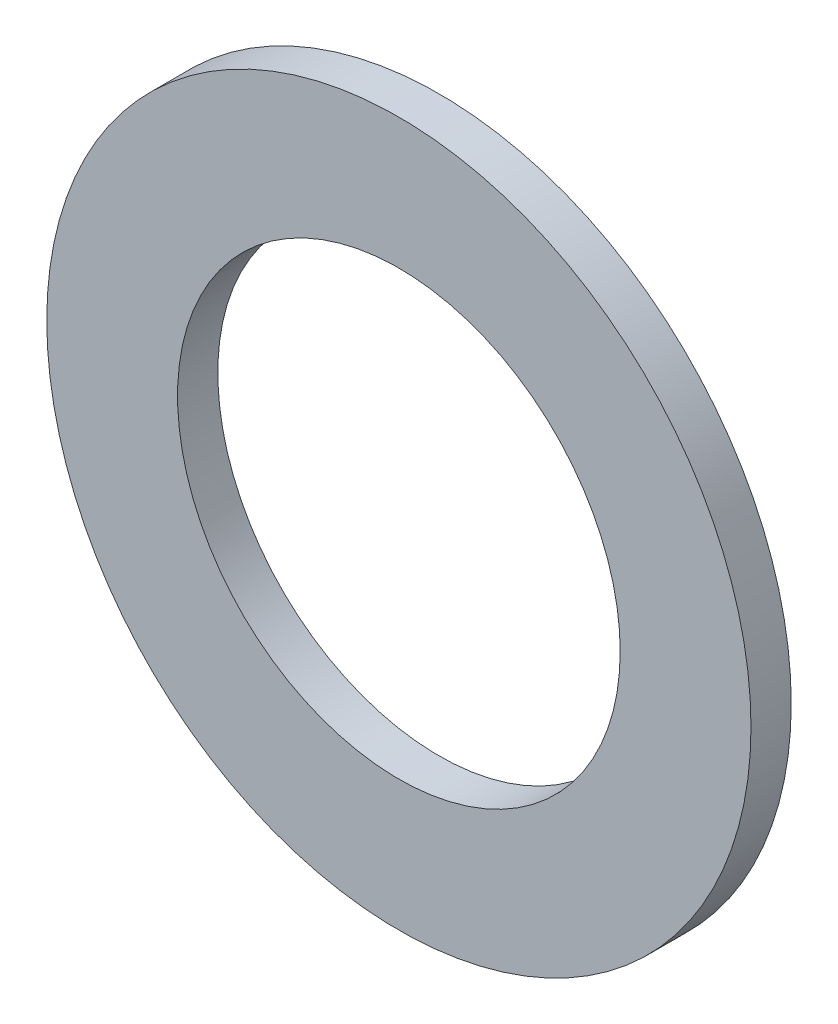
ISO-10303-21;
HEADER;
FILE_DESCRIPTION(('STEP AP214'),'2;1');
FILE_NAME('part.step','',(''),(''),'','','');
FILE_SCHEMA(('AUTOMOTIVE_DESIGN { 1 0 10303 214 1 1 1 1 }'));
ENDSEC;
DATA;
#1=APPLICATION_CONTEXT('core data for automotive mechanical design processes');
#2=APPLICATION_PROTOCOL_DEFINITION('international standard','automotive_design',2000,#1);
#3=PRODUCT_CONTEXT('',#1,'mechanical');
#4=PRODUCT('Part','Part','',(#3));
#5=PRODUCT_RELATED_PRODUCT_CATEGORY('part','',(#4));
#6=PRODUCT_DEFINITION_FORMATION('','',#4);
#7=PRODUCT_DEFINITION_CONTEXT('part definition',#1,'design');
#8=PRODUCT_DEFINITION('design','',#6,#7);
#9=PRODUCT_DEFINITION_SHAPE('','',#8);
#10=(LENGTH_UNIT() NAMED_UNIT(*) SI_UNIT(.MILLI.,.METRE.));
#11=(NAMED_UNIT(*) PLANE_ANGLE_UNIT() SI_UNIT($,.RADIAN.));
#12=(NAMED_UNIT(*) SI_UNIT($,.STERADIAN.) SOLID_ANGLE_UNIT());
#13=UNCERTAINTY_MEASURE_WITH_UNIT(LENGTH_MEASURE(1.E-05),#10,'distance_accuracy_value','');
#14=(GEOMETRIC_REPRESENTATION_CONTEXT(3) GLOBAL_UNCERTAINTY_ASSIGNED_CONTEXT((#13)) GLOBAL_UNIT_ASSIGNED_CONTEXT((#10,
#11,#12)) REPRESENTATION_CONTEXT('',''));
#15=CARTESIAN_POINT('',(0.,0.,0.));
#16=DIRECTION('',(0.,0.,1.));
#17=DIRECTION('',(1.,0.,0.));
#18=AXIS2_PLACEMENT_3D('',#15,#16,#17);
#19=CARTESIAN_POINT('',(-25.,0.,2.));
#20=DIRECTION('',(0.,0.,1.));
#21=DIRECTION('',(1.,0.,0.));
#22=AXIS2_PLACEMENT_3D('',#19,#20,#21);
#23=PLANE('',#22);
#24=CARTESIAN_POINT('',(-25.,0.,2.));
#25=DIRECTION('',(0.,0.,1.));
#26=DIRECTION('',(1.,0.,0.));
#27=AXIS2_PLACEMENT_3D('',#24,#25,#26);
#28=CIRCLE('',#27,17.5);
#29=CARTESIAN_POINT('',(-7.49999999999997,0.,2.00000000000002));
#30=VERTEX_POINT('',#29);
#31=EDGE_CURVE('E12',#30,#30,#28,.T.);
#32=ORIENTED_EDGE('',*,*,#31,.T.);
#33=EDGE_LOOP('',(#32));
#34=FACE_BOUND('',#33,.T.);
#35=CARTESIAN_POINT('',(-25.,0.,2.));
#36=DIRECTION('',(0.,0.,1.));
#37=DIRECTION('',(1.,0.,0.));
#38=AXIS2_PLACEMENT_3D('',#35,#36,#37);
#39=CIRCLE('',#38,11.);
#40=CARTESIAN_POINT('',(-14.,0.,2.00000000000001));
#41=VERTEX_POINT('',#40);
#42=EDGE_CURVE('E51',#41,#41,#39,.T.);
#43=ORIENTED_EDGE('',*,*,#42,.F.);
#44=EDGE_LOOP('',(#43));
#45=FACE_BOUND('',#44,.T.);
#46=ADVANCED_FACE('F40',(#34,#45),#23,.T.);
#47=CARTESIAN_POINT('',(-25.,0.,0.));
#48=DIRECTION('',(0.,0.,1.));
#49=DIRECTION('',(1.,0.,0.));
#50=AXIS2_PLACEMENT_3D('',#47,#48,#49);
#51=PLANE('',#50);
#52=CARTESIAN_POINT('',(-25.,0.,0.));
#53=DIRECTION('',(0.,0.,1.));
#54=DIRECTION('',(1.,0.,0.));
#55=AXIS2_PLACEMENT_3D('',#52,#53,#54);
#56=CIRCLE('',#55,17.5);
#57=CARTESIAN_POINT('',(-7.49999999999997,0.,0.));
#58=VERTEX_POINT('',#57);
#59=EDGE_CURVE('E44',#58,#58,#56,.T.);
#60=ORIENTED_EDGE('',*,*,#59,.F.);
#61=EDGE_LOOP('',(#60));
#62=FACE_BOUND('',#61,.T.);
#63=CARTESIAN_POINT('',(-25.,0.,0.));
#64=DIRECTION('',(0.,0.,1.));
#65=DIRECTION('',(1.,0.,0.));
#66=AXIS2_PLACEMENT_3D('',#63,#64,#65);
#67=CIRCLE('',#66,11.);
#68=CARTESIAN_POINT('',(-14.,0.,0.));
#69=VERTEX_POINT('',#68);
#70=EDGE_CURVE('E53',#69,#69,#67,.T.);
#71=ORIENTED_EDGE('',*,*,#70,.T.);
#72=EDGE_LOOP('',(#71));
#73=FACE_BOUND('',#72,.T.);
#74=ADVANCED_FACE('F63',(#62,#73),#51,.F.);
#75=CARTESIAN_POINT('',(-25.,0.,2.));
#76=DIRECTION('',(0.,0.,-1.));
#77=DIRECTION('',(-1.,0.,0.));
#78=AXIS2_PLACEMENT_3D('',#75,#76,#77);
#79=CYLINDRICAL_SURFACE('',#78,17.5);
#80=ORIENTED_EDGE('',*,*,#31,.F.);
#81=EDGE_LOOP('',(#80));
#82=FACE_BOUND('',#81,.T.);
#83=ORIENTED_EDGE('',*,*,#59,.T.);
#84=EDGE_LOOP('',(#83));
#85=FACE_BOUND('',#84,.T.);
#86=ADVANCED_FACE('F42',(#82,#85),#79,.T.);
#87=CARTESIAN_POINT('',(-25.,0.,2.));
#88=DIRECTION('',(0.,0.,-1.));
#89=DIRECTION('',(-1.,0.,0.));
#90=AXIS2_PLACEMENT_3D('',#87,#88,#89);
#91=CYLINDRICAL_SURFACE('',#90,11.);
#92=ORIENTED_EDGE('',*,*,#42,.T.);
#93=EDGE_LOOP('',(#92));
#94=FACE_BOUND('',#93,.T.);
#95=ORIENTED_EDGE('',*,*,#70,.F.);
#96=EDGE_LOOP('',(#95));
#97=FACE_BOUND('',#96,.T.);
#98=ADVANCED_FACE('F59',(#94,#97),#91,.F.);
#99=CLOSED_SHELL('',(#46,#74,#86,#98));
#100=MANIFOLD_SOLID_BREP('B2',#99);
#101=ADVANCED_BREP_SHAPE_REPRESENTATION('',(#18,#100),#14);
#102=SHAPE_DEFINITION_REPRESENTATION(#9,#101);
ENDSEC;
END-ISO-10303-21;
